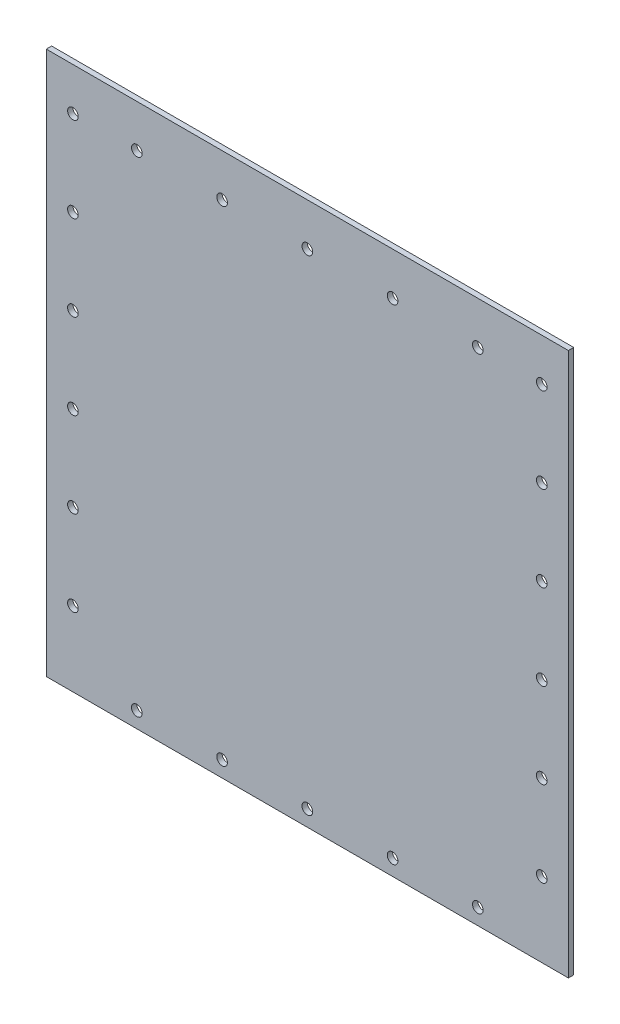
ISO-10303-21;
HEADER;
FILE_DESCRIPTION(('STEP AP214'),'2;1');
FILE_NAME('part.step','',(''),(''),'','','');
FILE_SCHEMA(('AUTOMOTIVE_DESIGN { 1 0 10303 214 1 1 1 1 }'));
ENDSEC;
DATA;
#1=APPLICATION_CONTEXT('core data for automotive mechanical design processes');
#2=APPLICATION_PROTOCOL_DEFINITION('international standard','automotive_design',2000,#1);
#3=PRODUCT_CONTEXT('',#1,'mechanical');
#4=PRODUCT('Part','Part','',(#3));
#5=PRODUCT_RELATED_PRODUCT_CATEGORY('part','',(#4));
#6=PRODUCT_DEFINITION_FORMATION('','',#4);
#7=PRODUCT_DEFINITION_CONTEXT('part definition',#1,'design');
#8=PRODUCT_DEFINITION('design','',#6,#7);
#9=PRODUCT_DEFINITION_SHAPE('','',#8);
#10=(LENGTH_UNIT() NAMED_UNIT(*) SI_UNIT(.MILLI.,.METRE.));
#11=(NAMED_UNIT(*) PLANE_ANGLE_UNIT() SI_UNIT($,.RADIAN.));
#12=(NAMED_UNIT(*) SI_UNIT($,.STERADIAN.) SOLID_ANGLE_UNIT());
#13=UNCERTAINTY_MEASURE_WITH_UNIT(LENGTH_MEASURE(1.E-05),#10,'distance_accuracy_value','');
#14=(GEOMETRIC_REPRESENTATION_CONTEXT(3) GLOBAL_UNCERTAINTY_ASSIGNED_CONTEXT((#13)) GLOBAL_UNIT_ASSIGNED_CONTEXT((#10,
#11,#12)) REPRESENTATION_CONTEXT('',''));
#15=CARTESIAN_POINT('',(0.,0.,0.));
#16=DIRECTION('',(0.,0.,1.));
#17=DIRECTION('',(1.,0.,0.));
#18=AXIS2_PLACEMENT_3D('',#15,#16,#17);
#19=CARTESIAN_POINT('',(0.,-107.95,1.5875));
#20=DIRECTION('',(0.,1.,0.));
#21=DIRECTION('',(0.,0.,1.));
#22=AXIS2_PLACEMENT_3D('',#19,#20,#21);
#23=PLANE('',#22);
#24=DIRECTION('',(1.,0.,0.));
#25=VECTOR('',#24,1.);
#26=CARTESIAN_POINT('',(0.,-107.95,0.));
#27=LINE('',#26,#25);
#28=CARTESIAN_POINT('',(0.,-107.95,0.));
#29=VERTEX_POINT('',#28);
#30=CARTESIAN_POINT('',(155.58,-107.95,0.));
#31=VERTEX_POINT('',#30);
#32=EDGE_CURVE('E121',#29,#31,#27,.T.);
#33=ORIENTED_EDGE('',*,*,#32,.F.);
#34=DIRECTION('',(0.,0.,-1.));
#35=VECTOR('',#34,1.);
#36=CARTESIAN_POINT('',(0.,-107.95,1.5875));
#37=LINE('',#36,#35);
#38=CARTESIAN_POINT('',(0.,-107.95,1.5875));
#39=VERTEX_POINT('',#38);
#40=EDGE_CURVE('E11',#39,#29,#37,.T.);
#41=ORIENTED_EDGE('',*,*,#40,.F.);
#42=DIRECTION('',(1.,0.,0.));
#43=VECTOR('',#42,1.);
#44=CARTESIAN_POINT('',(0.,-107.95,1.5875));
#45=LINE('',#44,#43);
#46=CARTESIAN_POINT('',(155.58,-107.95,1.5875));
#47=VERTEX_POINT('',#46);
#48=EDGE_CURVE('E98',#39,#47,#45,.T.);
#49=ORIENTED_EDGE('',*,*,#48,.T.);
#50=DIRECTION('',(0.,0.,-1.));
#51=VECTOR('',#50,1.);
#52=CARTESIAN_POINT('',(155.58,-107.95,1.5875));
#53=LINE('',#52,#51);
#54=EDGE_CURVE('E59',#47,#31,#53,.T.);
#55=ORIENTED_EDGE('',*,*,#54,.T.);
#56=EDGE_LOOP('',(#33,#41,#49,#55));
#57=FACE_BOUND('',#56,.T.);
#58=ADVANCED_FACE('F41',(#57),#23,.T.);
#59=CARTESIAN_POINT('',(0.,0.,1.5875));
#60=DIRECTION('',(1.,0.,0.));
#61=DIRECTION('',(0.,0.,-1.));
#62=AXIS2_PLACEMENT_3D('',#59,#60,#61);
#63=PLANE('',#62);
#64=DIRECTION('',(0.,-1.,0.));
#65=VECTOR('',#64,1.);
#66=CARTESIAN_POINT('',(0.,0.,0.));
#67=LINE('',#66,#65);
#68=CARTESIAN_POINT('',(0.,-269.872,0.));
#69=VERTEX_POINT('',#68);
#70=EDGE_CURVE('E104',#29,#69,#67,.T.);
#71=ORIENTED_EDGE('',*,*,#70,.T.);
#72=DIRECTION('',(0.,0.,-1.));
#73=VECTOR('',#72,1.);
#74=CARTESIAN_POINT('',(0.,-269.872,1.5875));
#75=LINE('',#74,#73);
#76=CARTESIAN_POINT('',(0.,-269.872,1.5875));
#77=VERTEX_POINT('',#76);
#78=EDGE_CURVE('E51',#77,#69,#75,.T.);
#79=ORIENTED_EDGE('',*,*,#78,.F.);
#80=DIRECTION('',(0.,-1.,0.));
#81=VECTOR('',#80,1.);
#82=CARTESIAN_POINT('',(0.,0.,1.5875));
#83=LINE('',#82,#81);
#84=EDGE_CURVE('E94',#39,#77,#83,.T.);
#85=ORIENTED_EDGE('',*,*,#84,.F.);
#86=ORIENTED_EDGE('',*,*,#40,.T.);
#87=EDGE_LOOP('',(#71,#79,#85,#86));
#88=FACE_BOUND('',#87,.T.);
#89=ADVANCED_FACE('F102',(#88),#63,.F.);
#90=CARTESIAN_POINT('',(0.,-269.872,1.5875));
#91=DIRECTION('',(0.,1.,0.));
#92=DIRECTION('',(0.,0.,1.));
#93=AXIS2_PLACEMENT_3D('',#90,#91,#92);
#94=PLANE('',#93);
#95=DIRECTION('',(1.,0.,0.));
#96=VECTOR('',#95,1.);
#97=CARTESIAN_POINT('',(0.,-269.872,0.));
#98=LINE('',#97,#96);
#99=CARTESIAN_POINT('',(155.58,-269.872,0.));
#100=VERTEX_POINT('',#99);
#101=EDGE_CURVE('E116',#69,#100,#98,.T.);
#102=ORIENTED_EDGE('',*,*,#101,.T.);
#103=DIRECTION('',(0.,0.,-1.));
#104=VECTOR('',#103,1.);
#105=CARTESIAN_POINT('',(155.58,-269.872,1.5875));
#106=LINE('',#105,#104);
#107=CARTESIAN_POINT('',(155.58,-269.872,1.5875));
#108=VERTEX_POINT('',#107);
#109=EDGE_CURVE('E73',#108,#100,#106,.T.);
#110=ORIENTED_EDGE('',*,*,#109,.F.);
#111=DIRECTION('',(1.,0.,0.));
#112=VECTOR('',#111,1.);
#113=CARTESIAN_POINT('',(0.,-269.872,1.5875));
#114=LINE('',#113,#112);
#115=EDGE_CURVE('E85',#77,#108,#114,.T.);
#116=ORIENTED_EDGE('',*,*,#115,.F.);
#117=ORIENTED_EDGE('',*,*,#78,.T.);
#118=EDGE_LOOP('',(#102,#110,#116,#117));
#119=FACE_BOUND('',#118,.T.);
#120=ADVANCED_FACE('F87',(#119),#94,.F.);
#121=CARTESIAN_POINT('',(147.64,-120.65,1.5875));
#122=DIRECTION('',(0.,0.,-1.));
#123=DIRECTION('',(-1.,0.,0.));
#124=AXIS2_PLACEMENT_3D('',#121,#122,#123);
#125=CYLINDRICAL_SURFACE('',#124,1.58750000000004);
#126=CARTESIAN_POINT('',(147.64,-120.65,1.5875));
#127=DIRECTION('',(0.,0.,1.));
#128=DIRECTION('',(1.,0.,0.));
#129=AXIS2_PLACEMENT_3D('',#126,#127,#128);
#130=CIRCLE('',#129,1.58750000000004);
#131=CARTESIAN_POINT('',(149.2275,-120.65,1.5875));
#132=VERTEX_POINT('',#131);
#133=EDGE_CURVE('E216',#132,#132,#130,.T.);
#134=ORIENTED_EDGE('',*,*,#133,.T.);
#135=EDGE_LOOP('',(#134));
#136=FACE_BOUND('',#135,.T.);
#137=CARTESIAN_POINT('',(147.64,-120.65,0.));
#138=DIRECTION('',(0.,0.,1.));
#139=DIRECTION('',(1.,0.,0.));
#140=AXIS2_PLACEMENT_3D('',#137,#138,#139);
#141=CIRCLE('',#140,1.58750000000004);
#142=CARTESIAN_POINT('',(149.2275,-120.65,0.));
#143=VERTEX_POINT('',#142);
#144=EDGE_CURVE('E124',#143,#143,#141,.T.);
#145=ORIENTED_EDGE('',*,*,#144,.F.);
#146=EDGE_LOOP('',(#145));
#147=FACE_BOUND('',#146,.T.);
#148=ADVANCED_FACE('F353',(#136,#147),#125,.F.);
#149=CARTESIAN_POINT('',(147.64,-146.05,1.5875));
#150=DIRECTION('',(0.,0.,-1.));
#151=DIRECTION('',(-1.,0.,0.));
#152=AXIS2_PLACEMENT_3D('',#149,#150,#151);
#153=CYLINDRICAL_SURFACE('',#152,1.58749999999999);
#154=CARTESIAN_POINT('',(147.64,-146.05,1.5875));
#155=DIRECTION('',(0.,0.,1.));
#156=DIRECTION('',(1.,0.,0.));
#157=AXIS2_PLACEMENT_3D('',#154,#155,#156);
#158=CIRCLE('',#157,1.58749999999999);
#159=CARTESIAN_POINT('',(149.2275,-146.05,1.5875));
#160=VERTEX_POINT('',#159);
#161=EDGE_CURVE('E220',#160,#160,#158,.T.);
#162=ORIENTED_EDGE('',*,*,#161,.T.);
#163=EDGE_LOOP('',(#162));
#164=FACE_BOUND('',#163,.T.);
#165=CARTESIAN_POINT('',(147.64,-146.05,0.));
#166=DIRECTION('',(0.,0.,1.));
#167=DIRECTION('',(1.,0.,0.));
#168=AXIS2_PLACEMENT_3D('',#165,#166,#167);
#169=CIRCLE('',#168,1.58749999999999);
#170=CARTESIAN_POINT('',(149.2275,-146.05,0.));
#171=VERTEX_POINT('',#170);
#172=EDGE_CURVE('E128',#171,#171,#169,.T.);
#173=ORIENTED_EDGE('',*,*,#172,.F.);
#174=EDGE_LOOP('',(#173));
#175=FACE_BOUND('',#174,.T.);
#176=ADVANCED_FACE('F356',(#164,#175),#153,.F.);
#177=CARTESIAN_POINT('',(147.64,-171.45,1.5875));
#178=DIRECTION('',(0.,0.,-1.));
#179=DIRECTION('',(-1.,0.,0.));
#180=AXIS2_PLACEMENT_3D('',#177,#178,#179);
#181=CYLINDRICAL_SURFACE('',#180,1.58749999999999);
#182=CARTESIAN_POINT('',(147.64,-171.45,1.5875));
#183=DIRECTION('',(0.,0.,1.));
#184=DIRECTION('',(1.,0.,0.));
#185=AXIS2_PLACEMENT_3D('',#182,#183,#184);
#186=CIRCLE('',#185,1.58749999999999);
#187=CARTESIAN_POINT('',(149.2275,-171.45,1.5875));
#188=VERTEX_POINT('',#187);
#189=EDGE_CURVE('E224',#188,#188,#186,.T.);
#190=ORIENTED_EDGE('',*,*,#189,.T.);
#191=EDGE_LOOP('',(#190));
#192=FACE_BOUND('',#191,.T.);
#193=CARTESIAN_POINT('',(147.64,-171.45,0.));
#194=DIRECTION('',(0.,0.,1.));
#195=DIRECTION('',(1.,0.,0.));
#196=AXIS2_PLACEMENT_3D('',#193,#194,#195);
#197=CIRCLE('',#196,1.58749999999999);
#198=CARTESIAN_POINT('',(149.2275,-171.45,0.));
#199=VERTEX_POINT('',#198);
#200=EDGE_CURVE('E132',#199,#199,#197,.T.);
#201=ORIENTED_EDGE('',*,*,#200,.F.);
#202=EDGE_LOOP('',(#201));
#203=FACE_BOUND('',#202,.T.);
#204=ADVANCED_FACE('F380',(#192,#203),#181,.F.);
#205=CARTESIAN_POINT('',(147.64,-196.85,1.5875));
#206=DIRECTION('',(0.,0.,-1.));
#207=DIRECTION('',(-1.,0.,0.));
#208=AXIS2_PLACEMENT_3D('',#205,#206,#207);
#209=CYLINDRICAL_SURFACE('',#208,1.58749999999999);
#210=CARTESIAN_POINT('',(147.64,-196.85,1.5875));
#211=DIRECTION('',(0.,0.,1.));
#212=DIRECTION('',(1.,0.,0.));
#213=AXIS2_PLACEMENT_3D('',#210,#211,#212);
#214=CIRCLE('',#213,1.58749999999999);
#215=CARTESIAN_POINT('',(149.2275,-196.85,1.5875));
#216=VERTEX_POINT('',#215);
#217=EDGE_CURVE('E228',#216,#216,#214,.T.);
#218=ORIENTED_EDGE('',*,*,#217,.T.);
#219=EDGE_LOOP('',(#218));
#220=FACE_BOUND('',#219,.T.);
#221=CARTESIAN_POINT('',(147.64,-196.85,0.));
#222=DIRECTION('',(0.,0.,1.));
#223=DIRECTION('',(1.,0.,0.));
#224=AXIS2_PLACEMENT_3D('',#221,#222,#223);
#225=CIRCLE('',#224,1.58749999999999);
#226=CARTESIAN_POINT('',(149.2275,-196.85,0.));
#227=VERTEX_POINT('',#226);
#228=EDGE_CURVE('E136',#227,#227,#225,.T.);
#229=ORIENTED_EDGE('',*,*,#228,.F.);
#230=EDGE_LOOP('',(#229));
#231=FACE_BOUND('',#230,.T.);
#232=ADVANCED_FACE('F384',(#220,#231),#209,.F.);
#233=CARTESIAN_POINT('',(147.64,-222.25,1.5875));
#234=DIRECTION('',(0.,0.,-1.));
#235=DIRECTION('',(-1.,0.,0.));
#236=AXIS2_PLACEMENT_3D('',#233,#234,#235);
#237=CYLINDRICAL_SURFACE('',#236,1.58749999999999);
#238=CARTESIAN_POINT('',(147.64,-222.25,1.5875));
#239=DIRECTION('',(0.,0.,1.));
#240=DIRECTION('',(1.,0.,0.));
#241=AXIS2_PLACEMENT_3D('',#238,#239,#240);
#242=CIRCLE('',#241,1.58749999999999);
#243=CARTESIAN_POINT('',(149.2275,-222.25,1.5875));
#244=VERTEX_POINT('',#243);
#245=EDGE_CURVE('E232',#244,#244,#242,.T.);
#246=ORIENTED_EDGE('',*,*,#245,.T.);
#247=EDGE_LOOP('',(#246));
#248=FACE_BOUND('',#247,.T.);
#249=CARTESIAN_POINT('',(147.64,-222.25,0.));
#250=DIRECTION('',(0.,0.,1.));
#251=DIRECTION('',(1.,0.,0.));
#252=AXIS2_PLACEMENT_3D('',#249,#250,#251);
#253=CIRCLE('',#252,1.58749999999999);
#254=CARTESIAN_POINT('',(149.2275,-222.25,0.));
#255=VERTEX_POINT('',#254);
#256=EDGE_CURVE('E140',#255,#255,#253,.T.);
#257=ORIENTED_EDGE('',*,*,#256,.F.);
#258=EDGE_LOOP('',(#257));
#259=FACE_BOUND('',#258,.T.);
#260=ADVANCED_FACE('F388',(#248,#259),#237,.F.);
#261=CARTESIAN_POINT('',(147.64,-247.65,1.5875));
#262=DIRECTION('',(0.,0.,-1.));
#263=DIRECTION('',(-1.,0.,0.));
#264=AXIS2_PLACEMENT_3D('',#261,#262,#263);
#265=CYLINDRICAL_SURFACE('',#264,1.58749999999999);
#266=CARTESIAN_POINT('',(147.64,-247.65,1.5875));
#267=DIRECTION('',(0.,0.,1.));
#268=DIRECTION('',(1.,0.,0.));
#269=AXIS2_PLACEMENT_3D('',#266,#267,#268);
#270=CIRCLE('',#269,1.58749999999999);
#271=CARTESIAN_POINT('',(149.2275,-247.65,1.5875));
#272=VERTEX_POINT('',#271);
#273=EDGE_CURVE('E236',#272,#272,#270,.T.);
#274=ORIENTED_EDGE('',*,*,#273,.T.);
#275=EDGE_LOOP('',(#274));
#276=FACE_BOUND('',#275,.T.);
#277=CARTESIAN_POINT('',(147.64,-247.65,0.));
#278=DIRECTION('',(0.,0.,1.));
#279=DIRECTION('',(1.,0.,0.));
#280=AXIS2_PLACEMENT_3D('',#277,#278,#279);
#281=CIRCLE('',#280,1.58749999999999);
#282=CARTESIAN_POINT('',(149.2275,-247.65,0.));
#283=VERTEX_POINT('',#282);
#284=EDGE_CURVE('E144',#283,#283,#281,.T.);
#285=ORIENTED_EDGE('',*,*,#284,.F.);
#286=EDGE_LOOP('',(#285));
#287=FACE_BOUND('',#286,.T.);
#288=ADVANCED_FACE('F392',(#276,#287),#265,.F.);
#289=CARTESIAN_POINT('',(7.94000000000002,-120.65,1.5875));
#290=DIRECTION('',(0.,0.,-1.));
#291=DIRECTION('',(-1.,0.,0.));
#292=AXIS2_PLACEMENT_3D('',#289,#290,#291);
#293=CYLINDRICAL_SURFACE('',#292,1.58749999999999);
#294=CARTESIAN_POINT('',(7.94000000000002,-120.65,1.5875));
#295=DIRECTION('',(0.,0.,1.));
#296=DIRECTION('',(1.,0.,0.));
#297=AXIS2_PLACEMENT_3D('',#294,#295,#296);
#298=CIRCLE('',#297,1.58749999999999);
#299=CARTESIAN_POINT('',(9.5275,-120.65,1.5875));
#300=VERTEX_POINT('',#299);
#301=EDGE_CURVE('E240',#300,#300,#298,.T.);
#302=ORIENTED_EDGE('',*,*,#301,.T.);
#303=EDGE_LOOP('',(#302));
#304=FACE_BOUND('',#303,.T.);
#305=CARTESIAN_POINT('',(7.94000000000002,-120.65,0.));
#306=DIRECTION('',(0.,0.,1.));
#307=DIRECTION('',(1.,0.,0.));
#308=AXIS2_PLACEMENT_3D('',#305,#306,#307);
#309=CIRCLE('',#308,1.58749999999999);
#310=CARTESIAN_POINT('',(9.5275,-120.65,0.));
#311=VERTEX_POINT('',#310);
#312=EDGE_CURVE('E148',#311,#311,#309,.T.);
#313=ORIENTED_EDGE('',*,*,#312,.F.);
#314=EDGE_LOOP('',(#313));
#315=FACE_BOUND('',#314,.T.);
#316=ADVANCED_FACE('F396',(#304,#315),#293,.F.);
#317=CARTESIAN_POINT('',(7.94000000000002,-146.05,1.5875));
#318=DIRECTION('',(0.,0.,-1.));
#319=DIRECTION('',(-1.,0.,0.));
#320=AXIS2_PLACEMENT_3D('',#317,#318,#319);
#321=CYLINDRICAL_SURFACE('',#320,1.58749999999999);
#322=CARTESIAN_POINT('',(7.94000000000002,-146.05,1.5875));
#323=DIRECTION('',(0.,0.,1.));
#324=DIRECTION('',(1.,0.,0.));
#325=AXIS2_PLACEMENT_3D('',#322,#323,#324);
#326=CIRCLE('',#325,1.58749999999999);
#327=CARTESIAN_POINT('',(9.5275,-146.05,1.5875));
#328=VERTEX_POINT('',#327);
#329=EDGE_CURVE('E244',#328,#328,#326,.T.);
#330=ORIENTED_EDGE('',*,*,#329,.T.);
#331=EDGE_LOOP('',(#330));
#332=FACE_BOUND('',#331,.T.);
#333=CARTESIAN_POINT('',(7.94000000000002,-146.05,0.));
#334=DIRECTION('',(0.,0.,1.));
#335=DIRECTION('',(1.,0.,0.));
#336=AXIS2_PLACEMENT_3D('',#333,#334,#335);
#337=CIRCLE('',#336,1.58749999999999);
#338=CARTESIAN_POINT('',(9.5275,-146.05,0.));
#339=VERTEX_POINT('',#338);
#340=EDGE_CURVE('E152',#339,#339,#337,.T.);
#341=ORIENTED_EDGE('',*,*,#340,.F.);
#342=EDGE_LOOP('',(#341));
#343=FACE_BOUND('',#342,.T.);
#344=ADVANCED_FACE('F400',(#332,#343),#321,.F.);
#345=CARTESIAN_POINT('',(7.94000000000002,-171.45,1.5875));
#346=DIRECTION('',(0.,0.,-1.));
#347=DIRECTION('',(-1.,0.,0.));
#348=AXIS2_PLACEMENT_3D('',#345,#346,#347);
#349=CYLINDRICAL_SURFACE('',#348,1.58749999999999);
#350=CARTESIAN_POINT('',(7.94000000000002,-171.45,1.5875));
#351=DIRECTION('',(0.,0.,1.));
#352=DIRECTION('',(1.,0.,0.));
#353=AXIS2_PLACEMENT_3D('',#350,#351,#352);
#354=CIRCLE('',#353,1.58749999999999);
#355=CARTESIAN_POINT('',(9.52750000000001,-171.45,1.5875));
#356=VERTEX_POINT('',#355);
#357=EDGE_CURVE('E248',#356,#356,#354,.T.);
#358=ORIENTED_EDGE('',*,*,#357,.T.);
#359=EDGE_LOOP('',(#358));
#360=FACE_BOUND('',#359,.T.);
#361=CARTESIAN_POINT('',(7.94000000000002,-171.45,0.));
#362=DIRECTION('',(0.,0.,1.));
#363=DIRECTION('',(1.,0.,0.));
#364=AXIS2_PLACEMENT_3D('',#361,#362,#363);
#365=CIRCLE('',#364,1.58749999999999);
#366=CARTESIAN_POINT('',(9.52750000000001,-171.45,0.));
#367=VERTEX_POINT('',#366);
#368=EDGE_CURVE('E156',#367,#367,#365,.T.);
#369=ORIENTED_EDGE('',*,*,#368,.F.);
#370=EDGE_LOOP('',(#369));
#371=FACE_BOUND('',#370,.T.);
#372=ADVANCED_FACE('F404',(#360,#371),#349,.F.);
#373=CARTESIAN_POINT('',(7.94000000000002,-196.85,1.5875));
#374=DIRECTION('',(0.,0.,-1.));
#375=DIRECTION('',(-1.,0.,0.));
#376=AXIS2_PLACEMENT_3D('',#373,#374,#375);
#377=CYLINDRICAL_SURFACE('',#376,1.58749999999999);
#378=CARTESIAN_POINT('',(7.94000000000002,-196.85,1.5875));
#379=DIRECTION('',(0.,0.,1.));
#380=DIRECTION('',(1.,0.,0.));
#381=AXIS2_PLACEMENT_3D('',#378,#379,#380);
#382=CIRCLE('',#381,1.58749999999999);
#383=CARTESIAN_POINT('',(9.52750000000001,-196.85,1.5875));
#384=VERTEX_POINT('',#383);
#385=EDGE_CURVE('E252',#384,#384,#382,.T.);
#386=ORIENTED_EDGE('',*,*,#385,.T.);
#387=EDGE_LOOP('',(#386));
#388=FACE_BOUND('',#387,.T.);
#389=CARTESIAN_POINT('',(7.94000000000002,-196.85,0.));
#390=DIRECTION('',(0.,0.,1.));
#391=DIRECTION('',(1.,0.,0.));
#392=AXIS2_PLACEMENT_3D('',#389,#390,#391);
#393=CIRCLE('',#392,1.58749999999999);
#394=CARTESIAN_POINT('',(9.52750000000001,-196.85,0.));
#395=VERTEX_POINT('',#394);
#396=EDGE_CURVE('E160',#395,#395,#393,.T.);
#397=ORIENTED_EDGE('',*,*,#396,.F.);
#398=EDGE_LOOP('',(#397));
#399=FACE_BOUND('',#398,.T.);
#400=ADVANCED_FACE('F408',(#388,#399),#377,.F.);
#401=CARTESIAN_POINT('',(7.94000000000003,-222.25,1.5875));
#402=DIRECTION('',(0.,0.,-1.));
#403=DIRECTION('',(-1.,0.,0.));
#404=AXIS2_PLACEMENT_3D('',#401,#402,#403);
#405=CYLINDRICAL_SURFACE('',#404,1.58749999999999);
#406=CARTESIAN_POINT('',(7.94000000000003,-222.25,1.5875));
#407=DIRECTION('',(0.,0.,1.));
#408=DIRECTION('',(1.,0.,0.));
#409=AXIS2_PLACEMENT_3D('',#406,#407,#408);
#410=CIRCLE('',#409,1.58749999999999);
#411=CARTESIAN_POINT('',(9.52750000000001,-222.25,1.5875));
#412=VERTEX_POINT('',#411);
#413=EDGE_CURVE('E256',#412,#412,#410,.T.);
#414=ORIENTED_EDGE('',*,*,#413,.T.);
#415=EDGE_LOOP('',(#414));
#416=FACE_BOUND('',#415,.T.);
#417=CARTESIAN_POINT('',(7.94000000000003,-222.25,0.));
#418=DIRECTION('',(0.,0.,1.));
#419=DIRECTION('',(1.,0.,0.));
#420=AXIS2_PLACEMENT_3D('',#417,#418,#419);
#421=CIRCLE('',#420,1.58749999999999);
#422=CARTESIAN_POINT('',(9.52750000000001,-222.25,0.));
#423=VERTEX_POINT('',#422);
#424=EDGE_CURVE('E164',#423,#423,#421,.T.);
#425=ORIENTED_EDGE('',*,*,#424,.F.);
#426=EDGE_LOOP('',(#425));
#427=FACE_BOUND('',#426,.T.);
#428=ADVANCED_FACE('F412',(#416,#427),#405,.F.);
#429=CARTESIAN_POINT('',(7.94000000000003,-247.65,1.5875));
#430=DIRECTION('',(0.,0.,-1.));
#431=DIRECTION('',(-1.,0.,0.));
#432=AXIS2_PLACEMENT_3D('',#429,#430,#431);
#433=CYLINDRICAL_SURFACE('',#432,1.58749999999999);
#434=CARTESIAN_POINT('',(7.94000000000003,-247.65,1.5875));
#435=DIRECTION('',(0.,0.,1.));
#436=DIRECTION('',(1.,0.,0.));
#437=AXIS2_PLACEMENT_3D('',#434,#435,#436);
#438=CIRCLE('',#437,1.58749999999999);
#439=CARTESIAN_POINT('',(9.52750000000002,-247.65,1.5875));
#440=VERTEX_POINT('',#439);
#441=EDGE_CURVE('E260',#440,#440,#438,.T.);
#442=ORIENTED_EDGE('',*,*,#441,.T.);
#443=EDGE_LOOP('',(#442));
#444=FACE_BOUND('',#443,.T.);
#445=CARTESIAN_POINT('',(7.94000000000003,-247.65,0.));
#446=DIRECTION('',(0.,0.,1.));
#447=DIRECTION('',(1.,0.,0.));
#448=AXIS2_PLACEMENT_3D('',#445,#446,#447);
#449=CIRCLE('',#448,1.58749999999999);
#450=CARTESIAN_POINT('',(9.52750000000002,-247.65,0.));
#451=VERTEX_POINT('',#450);
#452=EDGE_CURVE('E168',#451,#451,#449,.T.);
#453=ORIENTED_EDGE('',*,*,#452,.F.);
#454=EDGE_LOOP('',(#453));
#455=FACE_BOUND('',#454,.T.);
#456=ADVANCED_FACE('F416',(#444,#455),#433,.F.);
#457=CARTESIAN_POINT('',(26.987,-265.1125,1.5875));
#458=DIRECTION('',(0.,0.,-1.));
#459=DIRECTION('',(-1.,0.,0.));
#460=AXIS2_PLACEMENT_3D('',#457,#458,#459);
#461=CYLINDRICAL_SURFACE('',#460,1.5875);
#462=CARTESIAN_POINT('',(26.987,-265.1125,1.5875));
#463=DIRECTION('',(0.,0.,1.));
#464=DIRECTION('',(1.,0.,0.));
#465=AXIS2_PLACEMENT_3D('',#462,#463,#464);
#466=CIRCLE('',#465,1.5875);
#467=CARTESIAN_POINT('',(28.5745,-265.1125,1.5875));
#468=VERTEX_POINT('',#467);
#469=EDGE_CURVE('E264',#468,#468,#466,.T.);
#470=ORIENTED_EDGE('',*,*,#469,.T.);
#471=EDGE_LOOP('',(#470));
#472=FACE_BOUND('',#471,.T.);
#473=CARTESIAN_POINT('',(26.987,-265.1125,0.));
#474=DIRECTION('',(0.,0.,1.));
#475=DIRECTION('',(1.,0.,0.));
#476=AXIS2_PLACEMENT_3D('',#473,#474,#475);
#477=CIRCLE('',#476,1.5875);
#478=CARTESIAN_POINT('',(28.5745,-265.1125,0.));
#479=VERTEX_POINT('',#478);
#480=EDGE_CURVE('E172',#479,#479,#477,.T.);
#481=ORIENTED_EDGE('',*,*,#480,.F.);
#482=EDGE_LOOP('',(#481));
#483=FACE_BOUND('',#482,.T.);
#484=ADVANCED_FACE('F420',(#472,#483),#461,.F.);
#485=CARTESIAN_POINT('',(52.387,-265.1125,1.5875));
#486=DIRECTION('',(0.,0.,-1.));
#487=DIRECTION('',(-1.,0.,0.));
#488=AXIS2_PLACEMENT_3D('',#485,#486,#487);
#489=CYLINDRICAL_SURFACE('',#488,1.5875);
#490=CARTESIAN_POINT('',(52.387,-265.1125,1.5875));
#491=DIRECTION('',(0.,0.,1.));
#492=DIRECTION('',(1.,0.,0.));
#493=AXIS2_PLACEMENT_3D('',#490,#491,#492);
#494=CIRCLE('',#493,1.5875);
#495=CARTESIAN_POINT('',(53.9745,-265.1125,1.5875));
#496=VERTEX_POINT('',#495);
#497=EDGE_CURVE('E268',#496,#496,#494,.T.);
#498=ORIENTED_EDGE('',*,*,#497,.T.);
#499=EDGE_LOOP('',(#498));
#500=FACE_BOUND('',#499,.T.);
#501=CARTESIAN_POINT('',(52.387,-265.1125,0.));
#502=DIRECTION('',(0.,0.,1.));
#503=DIRECTION('',(1.,0.,0.));
#504=AXIS2_PLACEMENT_3D('',#501,#502,#503);
#505=CIRCLE('',#504,1.5875);
#506=CARTESIAN_POINT('',(53.9745,-265.1125,0.));
#507=VERTEX_POINT('',#506);
#508=EDGE_CURVE('E176',#507,#507,#505,.T.);
#509=ORIENTED_EDGE('',*,*,#508,.F.);
#510=EDGE_LOOP('',(#509));
#511=FACE_BOUND('',#510,.T.);
#512=ADVANCED_FACE('F424',(#500,#511),#489,.F.);
#513=CARTESIAN_POINT('',(77.787,-265.1125,1.5875));
#514=DIRECTION('',(0.,0.,-1.));
#515=DIRECTION('',(-1.,0.,0.));
#516=AXIS2_PLACEMENT_3D('',#513,#514,#515);
#517=CYLINDRICAL_SURFACE('',#516,1.58749999999999);
#518=CARTESIAN_POINT('',(77.787,-265.1125,1.5875));
#519=DIRECTION('',(0.,0.,1.));
#520=DIRECTION('',(1.,0.,0.));
#521=AXIS2_PLACEMENT_3D('',#518,#519,#520);
#522=CIRCLE('',#521,1.58749999999999);
#523=CARTESIAN_POINT('',(79.3745,-265.1125,1.5875));
#524=VERTEX_POINT('',#523);
#525=EDGE_CURVE('E272',#524,#524,#522,.T.);
#526=ORIENTED_EDGE('',*,*,#525,.T.);
#527=EDGE_LOOP('',(#526));
#528=FACE_BOUND('',#527,.T.);
#529=CARTESIAN_POINT('',(77.787,-265.1125,0.));
#530=DIRECTION('',(0.,0.,1.));
#531=DIRECTION('',(1.,0.,0.));
#532=AXIS2_PLACEMENT_3D('',#529,#530,#531);
#533=CIRCLE('',#532,1.58749999999999);
#534=CARTESIAN_POINT('',(79.3745,-265.1125,0.));
#535=VERTEX_POINT('',#534);
#536=EDGE_CURVE('E180',#535,#535,#533,.T.);
#537=ORIENTED_EDGE('',*,*,#536,.F.);
#538=EDGE_LOOP('',(#537));
#539=FACE_BOUND('',#538,.T.);
#540=ADVANCED_FACE('F428',(#528,#539),#517,.F.);
#541=CARTESIAN_POINT('',(103.187,-265.1125,1.5875));
#542=DIRECTION('',(0.,0.,-1.));
#543=DIRECTION('',(-1.,0.,0.));
#544=AXIS2_PLACEMENT_3D('',#541,#542,#543);
#545=CYLINDRICAL_SURFACE('',#544,1.5875);
#546=CARTESIAN_POINT('',(103.187,-265.1125,1.5875));
#547=DIRECTION('',(0.,0.,1.));
#548=DIRECTION('',(1.,0.,0.));
#549=AXIS2_PLACEMENT_3D('',#546,#547,#548);
#550=CIRCLE('',#549,1.5875);
#551=CARTESIAN_POINT('',(104.7745,-265.1125,1.5875));
#552=VERTEX_POINT('',#551);
#553=EDGE_CURVE('E276',#552,#552,#550,.T.);
#554=ORIENTED_EDGE('',*,*,#553,.T.);
#555=EDGE_LOOP('',(#554));
#556=FACE_BOUND('',#555,.T.);
#557=CARTESIAN_POINT('',(103.187,-265.1125,0.));
#558=DIRECTION('',(0.,0.,1.));
#559=DIRECTION('',(1.,0.,0.));
#560=AXIS2_PLACEMENT_3D('',#557,#558,#559);
#561=CIRCLE('',#560,1.5875);
#562=CARTESIAN_POINT('',(104.7745,-265.1125,0.));
#563=VERTEX_POINT('',#562);
#564=EDGE_CURVE('E184',#563,#563,#561,.T.);
#565=ORIENTED_EDGE('',*,*,#564,.F.);
#566=EDGE_LOOP('',(#565));
#567=FACE_BOUND('',#566,.T.);
#568=ADVANCED_FACE('F432',(#556,#567),#545,.F.);
#569=CARTESIAN_POINT('',(128.587,-265.1125,1.5875));
#570=DIRECTION('',(0.,0.,-1.));
#571=DIRECTION('',(-1.,0.,0.));
#572=AXIS2_PLACEMENT_3D('',#569,#570,#571);
#573=CYLINDRICAL_SURFACE('',#572,1.58749999999999);
#574=CARTESIAN_POINT('',(128.587,-265.1125,1.5875));
#575=DIRECTION('',(0.,0.,1.));
#576=DIRECTION('',(1.,0.,0.));
#577=AXIS2_PLACEMENT_3D('',#574,#575,#576);
#578=CIRCLE('',#577,1.58749999999999);
#579=CARTESIAN_POINT('',(130.1745,-265.1125,1.5875));
#580=VERTEX_POINT('',#579);
#581=EDGE_CURVE('E280',#580,#580,#578,.T.);
#582=ORIENTED_EDGE('',*,*,#581,.T.);
#583=EDGE_LOOP('',(#582));
#584=FACE_BOUND('',#583,.T.);
#585=CARTESIAN_POINT('',(128.587,-265.1125,0.));
#586=DIRECTION('',(0.,0.,1.));
#587=DIRECTION('',(1.,0.,0.));
#588=AXIS2_PLACEMENT_3D('',#585,#586,#587);
#589=CIRCLE('',#588,1.58749999999999);
#590=CARTESIAN_POINT('',(130.1745,-265.1125,0.));
#591=VERTEX_POINT('',#590);
#592=EDGE_CURVE('E188',#591,#591,#589,.T.);
#593=ORIENTED_EDGE('',*,*,#592,.F.);
#594=EDGE_LOOP('',(#593));
#595=FACE_BOUND('',#594,.T.);
#596=ADVANCED_FACE('F436',(#584,#595),#573,.F.);
#597=CARTESIAN_POINT('',(26.99,-120.65,1.5875));
#598=DIRECTION('',(0.,0.,-1.));
#599=DIRECTION('',(-1.,0.,0.));
#600=AXIS2_PLACEMENT_3D('',#597,#598,#599);
#601=CYLINDRICAL_SURFACE('',#600,1.5875);
#602=CARTESIAN_POINT('',(26.99,-120.65,1.5875));
#603=DIRECTION('',(0.,0.,1.));
#604=DIRECTION('',(1.,0.,0.));
#605=AXIS2_PLACEMENT_3D('',#602,#603,#604);
#606=CIRCLE('',#605,1.5875);
#607=CARTESIAN_POINT('',(28.5775,-120.65,1.5875));
#608=VERTEX_POINT('',#607);
#609=EDGE_CURVE('E284',#608,#608,#606,.T.);
#610=ORIENTED_EDGE('',*,*,#609,.T.);
#611=EDGE_LOOP('',(#610));
#612=FACE_BOUND('',#611,.T.);
#613=CARTESIAN_POINT('',(26.99,-120.65,0.));
#614=DIRECTION('',(0.,0.,1.));
#615=DIRECTION('',(1.,0.,0.));
#616=AXIS2_PLACEMENT_3D('',#613,#614,#615);
#617=CIRCLE('',#616,1.5875);
#618=CARTESIAN_POINT('',(28.5775,-120.65,0.));
#619=VERTEX_POINT('',#618);
#620=EDGE_CURVE('E192',#619,#619,#617,.T.);
#621=ORIENTED_EDGE('',*,*,#620,.F.);
#622=EDGE_LOOP('',(#621));
#623=FACE_BOUND('',#622,.T.);
#624=ADVANCED_FACE('F440',(#612,#623),#601,.F.);
#625=CARTESIAN_POINT('',(52.39,-120.65,1.5875));
#626=DIRECTION('',(0.,0.,-1.));
#627=DIRECTION('',(-1.,0.,0.));
#628=AXIS2_PLACEMENT_3D('',#625,#626,#627);
#629=CYLINDRICAL_SURFACE('',#628,1.5875);
#630=CARTESIAN_POINT('',(52.39,-120.65,1.5875));
#631=DIRECTION('',(0.,0.,1.));
#632=DIRECTION('',(1.,0.,0.));
#633=AXIS2_PLACEMENT_3D('',#630,#631,#632);
#634=CIRCLE('',#633,1.5875);
#635=CARTESIAN_POINT('',(53.9775,-120.65,1.5875));
#636=VERTEX_POINT('',#635);
#637=EDGE_CURVE('E288',#636,#636,#634,.T.);
#638=ORIENTED_EDGE('',*,*,#637,.T.);
#639=EDGE_LOOP('',(#638));
#640=FACE_BOUND('',#639,.T.);
#641=CARTESIAN_POINT('',(52.39,-120.65,0.));
#642=DIRECTION('',(0.,0.,1.));
#643=DIRECTION('',(1.,0.,0.));
#644=AXIS2_PLACEMENT_3D('',#641,#642,#643);
#645=CIRCLE('',#644,1.5875);
#646=CARTESIAN_POINT('',(53.9775,-120.65,0.));
#647=VERTEX_POINT('',#646);
#648=EDGE_CURVE('E196',#647,#647,#645,.T.);
#649=ORIENTED_EDGE('',*,*,#648,.F.);
#650=EDGE_LOOP('',(#649));
#651=FACE_BOUND('',#650,.T.);
#652=ADVANCED_FACE('F444',(#640,#651),#629,.F.);
#653=CARTESIAN_POINT('',(77.79,-120.65,1.5875));
#654=DIRECTION('',(0.,0.,-1.));
#655=DIRECTION('',(-1.,0.,0.));
#656=AXIS2_PLACEMENT_3D('',#653,#654,#655);
#657=CYLINDRICAL_SURFACE('',#656,1.58749999999999);
#658=CARTESIAN_POINT('',(77.79,-120.65,1.5875));
#659=DIRECTION('',(0.,0.,1.));
#660=DIRECTION('',(1.,0.,0.));
#661=AXIS2_PLACEMENT_3D('',#658,#659,#660);
#662=CIRCLE('',#661,1.58749999999999);
#663=CARTESIAN_POINT('',(79.3775,-120.65,1.5875));
#664=VERTEX_POINT('',#663);
#665=EDGE_CURVE('E292',#664,#664,#662,.T.);
#666=ORIENTED_EDGE('',*,*,#665,.T.);
#667=EDGE_LOOP('',(#666));
#668=FACE_BOUND('',#667,.T.);
#669=CARTESIAN_POINT('',(77.79,-120.65,0.));
#670=DIRECTION('',(0.,0.,1.));
#671=DIRECTION('',(1.,0.,0.));
#672=AXIS2_PLACEMENT_3D('',#669,#670,#671);
#673=CIRCLE('',#672,1.58749999999999);
#674=CARTESIAN_POINT('',(79.3775,-120.65,0.));
#675=VERTEX_POINT('',#674);
#676=EDGE_CURVE('E200',#675,#675,#673,.T.);
#677=ORIENTED_EDGE('',*,*,#676,.F.);
#678=EDGE_LOOP('',(#677));
#679=FACE_BOUND('',#678,.T.);
#680=ADVANCED_FACE('F448',(#668,#679),#657,.F.);
#681=CARTESIAN_POINT('',(103.19,-120.65,1.5875));
#682=DIRECTION('',(0.,0.,-1.));
#683=DIRECTION('',(-1.,0.,0.));
#684=AXIS2_PLACEMENT_3D('',#681,#682,#683);
#685=CYLINDRICAL_SURFACE('',#684,1.5875);
#686=CARTESIAN_POINT('',(103.19,-120.65,1.5875));
#687=DIRECTION('',(0.,0.,1.));
#688=DIRECTION('',(1.,0.,0.));
#689=AXIS2_PLACEMENT_3D('',#686,#687,#688);
#690=CIRCLE('',#689,1.5875);
#691=CARTESIAN_POINT('',(104.7775,-120.65,1.5875));
#692=VERTEX_POINT('',#691);
#693=EDGE_CURVE('E296',#692,#692,#690,.T.);
#694=ORIENTED_EDGE('',*,*,#693,.T.);
#695=EDGE_LOOP('',(#694));
#696=FACE_BOUND('',#695,.T.);
#697=CARTESIAN_POINT('',(103.19,-120.65,0.));
#698=DIRECTION('',(0.,0.,1.));
#699=DIRECTION('',(1.,0.,0.));
#700=AXIS2_PLACEMENT_3D('',#697,#698,#699);
#701=CIRCLE('',#700,1.5875);
#702=CARTESIAN_POINT('',(104.7775,-120.65,0.));
#703=VERTEX_POINT('',#702);
#704=EDGE_CURVE('E204',#703,#703,#701,.T.);
#705=ORIENTED_EDGE('',*,*,#704,.F.);
#706=EDGE_LOOP('',(#705));
#707=FACE_BOUND('',#706,.T.);
#708=ADVANCED_FACE('F369',(#696,#707),#685,.F.);
#709=CARTESIAN_POINT('',(128.59,-120.65,1.5875));
#710=DIRECTION('',(0.,0.,-1.));
#711=DIRECTION('',(-1.,0.,0.));
#712=AXIS2_PLACEMENT_3D('',#709,#710,#711);
#713=CYLINDRICAL_SURFACE('',#712,1.58750000000002);
#714=CARTESIAN_POINT('',(128.59,-120.65,1.5875));
#715=DIRECTION('',(0.,0.,1.));
#716=DIRECTION('',(1.,0.,0.));
#717=AXIS2_PLACEMENT_3D('',#714,#715,#716);
#718=CIRCLE('',#717,1.58750000000002);
#719=CARTESIAN_POINT('',(130.1775,-120.65,1.5875));
#720=VERTEX_POINT('',#719);
#721=EDGE_CURVE('E115',#720,#720,#718,.T.);
#722=ORIENTED_EDGE('',*,*,#721,.T.);
#723=EDGE_LOOP('',(#722));
#724=FACE_BOUND('',#723,.T.);
#725=CARTESIAN_POINT('',(128.59,-120.65,0.));
#726=DIRECTION('',(0.,0.,1.));
#727=DIRECTION('',(1.,0.,0.));
#728=AXIS2_PLACEMENT_3D('',#725,#726,#727);
#729=CIRCLE('',#728,1.58750000000002);
#730=CARTESIAN_POINT('',(130.1775,-120.65,0.));
#731=VERTEX_POINT('',#730);
#732=EDGE_CURVE('E208',#731,#731,#729,.T.);
#733=ORIENTED_EDGE('',*,*,#732,.F.);
#734=EDGE_LOOP('',(#733));
#735=FACE_BOUND('',#734,.T.);
#736=ADVANCED_FACE('F43',(#724,#735),#713,.F.);
#737=CARTESIAN_POINT('',(155.58,0.,1.5875));
#738=DIRECTION('',(1.,0.,0.));
#739=DIRECTION('',(0.,0.,-1.));
#740=AXIS2_PLACEMENT_3D('',#737,#738,#739);
#741=PLANE('',#740);
#742=DIRECTION('',(0.,-1.,0.));
#743=VECTOR('',#742,1.);
#744=CARTESIAN_POINT('',(155.58,0.,0.));
#745=LINE('',#744,#743);
#746=EDGE_CURVE('E111',#31,#100,#745,.T.);
#747=ORIENTED_EDGE('',*,*,#746,.F.);
#748=ORIENTED_EDGE('',*,*,#54,.F.);
#749=DIRECTION('',(0.,-1.,0.));
#750=VECTOR('',#749,1.);
#751=CARTESIAN_POINT('',(155.58,0.,1.5875));
#752=LINE('',#751,#750);
#753=EDGE_CURVE('E93',#47,#108,#752,.T.);
#754=ORIENTED_EDGE('',*,*,#753,.T.);
#755=ORIENTED_EDGE('',*,*,#109,.T.);
#756=EDGE_LOOP('',(#747,#748,#754,#755));
#757=FACE_BOUND('',#756,.T.);
#758=ADVANCED_FACE('F309',(#757),#741,.T.);
#759=CARTESIAN_POINT('',(0.,0.,1.5875));
#760=DIRECTION('',(0.,0.,1.));
#761=DIRECTION('',(1.,0.,0.));
#762=AXIS2_PLACEMENT_3D('',#759,#760,#761);
#763=PLANE('',#762);
#764=ORIENTED_EDGE('',*,*,#721,.F.);
#765=EDGE_LOOP('',(#764));
#766=FACE_BOUND('',#765,.T.);
#767=ORIENTED_EDGE('',*,*,#693,.F.);
#768=EDGE_LOOP('',(#767));
#769=FACE_BOUND('',#768,.T.);
#770=ORIENTED_EDGE('',*,*,#665,.F.);
#771=EDGE_LOOP('',(#770));
#772=FACE_BOUND('',#771,.T.);
#773=ORIENTED_EDGE('',*,*,#637,.F.);
#774=EDGE_LOOP('',(#773));
#775=FACE_BOUND('',#774,.T.);
#776=ORIENTED_EDGE('',*,*,#609,.F.);
#777=EDGE_LOOP('',(#776));
#778=FACE_BOUND('',#777,.T.);
#779=ORIENTED_EDGE('',*,*,#581,.F.);
#780=EDGE_LOOP('',(#779));
#781=FACE_BOUND('',#780,.T.);
#782=ORIENTED_EDGE('',*,*,#553,.F.);
#783=EDGE_LOOP('',(#782));
#784=FACE_BOUND('',#783,.T.);
#785=ORIENTED_EDGE('',*,*,#525,.F.);
#786=EDGE_LOOP('',(#785));
#787=FACE_BOUND('',#786,.T.);
#788=ORIENTED_EDGE('',*,*,#497,.F.);
#789=EDGE_LOOP('',(#788));
#790=FACE_BOUND('',#789,.T.);
#791=ORIENTED_EDGE('',*,*,#469,.F.);
#792=EDGE_LOOP('',(#791));
#793=FACE_BOUND('',#792,.T.);
#794=ORIENTED_EDGE('',*,*,#441,.F.);
#795=EDGE_LOOP('',(#794));
#796=FACE_BOUND('',#795,.T.);
#797=ORIENTED_EDGE('',*,*,#413,.F.);
#798=EDGE_LOOP('',(#797));
#799=FACE_BOUND('',#798,.T.);
#800=ORIENTED_EDGE('',*,*,#385,.F.);
#801=EDGE_LOOP('',(#800));
#802=FACE_BOUND('',#801,.T.);
#803=ORIENTED_EDGE('',*,*,#357,.F.);
#804=EDGE_LOOP('',(#803));
#805=FACE_BOUND('',#804,.T.);
#806=ORIENTED_EDGE('',*,*,#329,.F.);
#807=EDGE_LOOP('',(#806));
#808=FACE_BOUND('',#807,.T.);
#809=ORIENTED_EDGE('',*,*,#301,.F.);
#810=EDGE_LOOP('',(#809));
#811=FACE_BOUND('',#810,.T.);
#812=ORIENTED_EDGE('',*,*,#273,.F.);
#813=EDGE_LOOP('',(#812));
#814=FACE_BOUND('',#813,.T.);
#815=ORIENTED_EDGE('',*,*,#245,.F.);
#816=EDGE_LOOP('',(#815));
#817=FACE_BOUND('',#816,.T.);
#818=ORIENTED_EDGE('',*,*,#217,.F.);
#819=EDGE_LOOP('',(#818));
#820=FACE_BOUND('',#819,.T.);
#821=ORIENTED_EDGE('',*,*,#189,.F.);
#822=EDGE_LOOP('',(#821));
#823=FACE_BOUND('',#822,.T.);
#824=ORIENTED_EDGE('',*,*,#161,.F.);
#825=EDGE_LOOP('',(#824));
#826=FACE_BOUND('',#825,.T.);
#827=ORIENTED_EDGE('',*,*,#133,.F.);
#828=EDGE_LOOP('',(#827));
#829=FACE_BOUND('',#828,.T.);
#830=ORIENTED_EDGE('',*,*,#48,.F.);
#831=ORIENTED_EDGE('',*,*,#84,.T.);
#832=ORIENTED_EDGE('',*,*,#115,.T.);
#833=ORIENTED_EDGE('',*,*,#753,.F.);
#834=EDGE_LOOP('',(#830,#831,#832,#833));
#835=FACE_BOUND('',#834,.T.);
#836=ADVANCED_FACE('F97',(#766,#769,#772,#775,#778,#781,#784,#787,#790,#793,#796,#799,#802,#805,
#808,#811,#814,#817,#820,#823,#826,#829,#835),#763,.T.);
#837=CARTESIAN_POINT('',(0.,0.,0.));
#838=DIRECTION('',(0.,0.,1.));
#839=DIRECTION('',(1.,0.,0.));
#840=AXIS2_PLACEMENT_3D('',#837,#838,#839);
#841=PLANE('',#840);
#842=ORIENTED_EDGE('',*,*,#732,.T.);
#843=EDGE_LOOP('',(#842));
#844=FACE_BOUND('',#843,.T.);
#845=ORIENTED_EDGE('',*,*,#704,.T.);
#846=EDGE_LOOP('',(#845));
#847=FACE_BOUND('',#846,.T.);
#848=ORIENTED_EDGE('',*,*,#676,.T.);
#849=EDGE_LOOP('',(#848));
#850=FACE_BOUND('',#849,.T.);
#851=ORIENTED_EDGE('',*,*,#648,.T.);
#852=EDGE_LOOP('',(#851));
#853=FACE_BOUND('',#852,.T.);
#854=ORIENTED_EDGE('',*,*,#620,.T.);
#855=EDGE_LOOP('',(#854));
#856=FACE_BOUND('',#855,.T.);
#857=ORIENTED_EDGE('',*,*,#592,.T.);
#858=EDGE_LOOP('',(#857));
#859=FACE_BOUND('',#858,.T.);
#860=ORIENTED_EDGE('',*,*,#564,.T.);
#861=EDGE_LOOP('',(#860));
#862=FACE_BOUND('',#861,.T.);
#863=ORIENTED_EDGE('',*,*,#536,.T.);
#864=EDGE_LOOP('',(#863));
#865=FACE_BOUND('',#864,.T.);
#866=ORIENTED_EDGE('',*,*,#508,.T.);
#867=EDGE_LOOP('',(#866));
#868=FACE_BOUND('',#867,.T.);
#869=ORIENTED_EDGE('',*,*,#480,.T.);
#870=EDGE_LOOP('',(#869));
#871=FACE_BOUND('',#870,.T.);
#872=ORIENTED_EDGE('',*,*,#452,.T.);
#873=EDGE_LOOP('',(#872));
#874=FACE_BOUND('',#873,.T.);
#875=ORIENTED_EDGE('',*,*,#424,.T.);
#876=EDGE_LOOP('',(#875));
#877=FACE_BOUND('',#876,.T.);
#878=ORIENTED_EDGE('',*,*,#396,.T.);
#879=EDGE_LOOP('',(#878));
#880=FACE_BOUND('',#879,.T.);
#881=ORIENTED_EDGE('',*,*,#368,.T.);
#882=EDGE_LOOP('',(#881));
#883=FACE_BOUND('',#882,.T.);
#884=ORIENTED_EDGE('',*,*,#340,.T.);
#885=EDGE_LOOP('',(#884));
#886=FACE_BOUND('',#885,.T.);
#887=ORIENTED_EDGE('',*,*,#312,.T.);
#888=EDGE_LOOP('',(#887));
#889=FACE_BOUND('',#888,.T.);
#890=ORIENTED_EDGE('',*,*,#284,.T.);
#891=EDGE_LOOP('',(#890));
#892=FACE_BOUND('',#891,.T.);
#893=ORIENTED_EDGE('',*,*,#256,.T.);
#894=EDGE_LOOP('',(#893));
#895=FACE_BOUND('',#894,.T.);
#896=ORIENTED_EDGE('',*,*,#228,.T.);
#897=EDGE_LOOP('',(#896));
#898=FACE_BOUND('',#897,.T.);
#899=ORIENTED_EDGE('',*,*,#200,.T.);
#900=EDGE_LOOP('',(#899));
#901=FACE_BOUND('',#900,.T.);
#902=ORIENTED_EDGE('',*,*,#172,.T.);
#903=EDGE_LOOP('',(#902));
#904=FACE_BOUND('',#903,.T.);
#905=ORIENTED_EDGE('',*,*,#144,.T.);
#906=EDGE_LOOP('',(#905));
#907=FACE_BOUND('',#906,.T.);
#908=ORIENTED_EDGE('',*,*,#32,.T.);
#909=ORIENTED_EDGE('',*,*,#746,.T.);
#910=ORIENTED_EDGE('',*,*,#101,.F.);
#911=ORIENTED_EDGE('',*,*,#70,.F.);
#912=EDGE_LOOP('',(#908,#909,#910,#911));
#913=FACE_BOUND('',#912,.T.);
#914=ADVANCED_FACE('F308',(#844,#847,#850,#853,#856,#859,#862,#865,#868,#871,#874,#877,#880,
#883,#886,#889,#892,#895,#898,#901,#904,#907,#913),#841,.F.);
#915=CLOSED_SHELL('',(#58,#89,#120,#148,#176,#204,#232,#260,#288,#316,#344,#372,#400,#428,#456,
#484,#512,#540,#568,#596,#624,#652,#680,#708,#736,#758,#836,#914));
#916=MANIFOLD_SOLID_BREP('B2',#915);
#917=ADVANCED_BREP_SHAPE_REPRESENTATION('',(#18,#916),#14);
#918=SHAPE_DEFINITION_REPRESENTATION(#9,#917);
ENDSEC;
END-ISO-10303-21;
